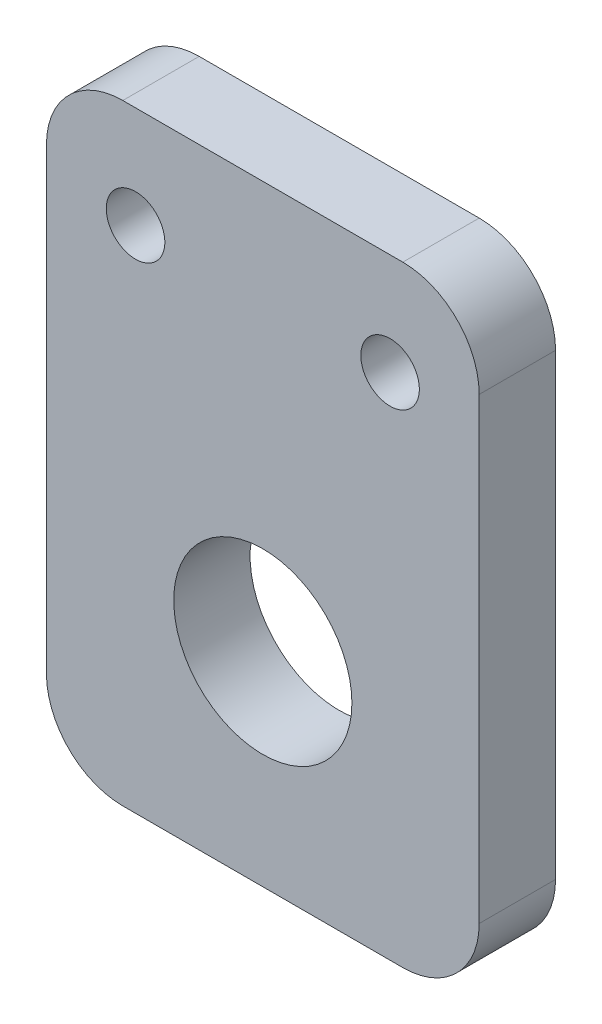
ISO-10303-21;
HEADER;
FILE_DESCRIPTION(('STEP AP214'),'2;1');
FILE_NAME('part.step','',(''),(''),'','','');
FILE_SCHEMA(('AUTOMOTIVE_DESIGN { 1 0 10303 214 1 1 1 1 }'));
ENDSEC;
DATA;
#1=APPLICATION_CONTEXT('core data for automotive mechanical design processes');
#2=APPLICATION_PROTOCOL_DEFINITION('international standard','automotive_design',2000,#1);
#3=PRODUCT_CONTEXT('',#1,'mechanical');
#4=PRODUCT('Part','Part','',(#3));
#5=PRODUCT_RELATED_PRODUCT_CATEGORY('part','',(#4));
#6=PRODUCT_DEFINITION_FORMATION('','',#4);
#7=PRODUCT_DEFINITION_CONTEXT('part definition',#1,'design');
#8=PRODUCT_DEFINITION('design','',#6,#7);
#9=PRODUCT_DEFINITION_SHAPE('','',#8);
#10=(LENGTH_UNIT() NAMED_UNIT(*) SI_UNIT(.MILLI.,.METRE.));
#11=(NAMED_UNIT(*) PLANE_ANGLE_UNIT() SI_UNIT($,.RADIAN.));
#12=(NAMED_UNIT(*) SI_UNIT($,.STERADIAN.) SOLID_ANGLE_UNIT());
#13=UNCERTAINTY_MEASURE_WITH_UNIT(LENGTH_MEASURE(1.E-05),#10,'distance_accuracy_value','');
#14=(GEOMETRIC_REPRESENTATION_CONTEXT(3) GLOBAL_UNCERTAINTY_ASSIGNED_CONTEXT((#13)) GLOBAL_UNIT_ASSIGNED_CONTEXT((#10,
#11,#12)) REPRESENTATION_CONTEXT('',''));
#15=CARTESIAN_POINT('',(0.,0.,0.));
#16=DIRECTION('',(0.,0.,1.));
#17=DIRECTION('',(1.,0.,0.));
#18=AXIS2_PLACEMENT_3D('',#15,#16,#17);
#19=CARTESIAN_POINT('',(0.,0.,3.));
#20=DIRECTION('',(0.,0.,-1.));
#21=DIRECTION('',(-1.,0.,0.));
#22=AXIS2_PLACEMENT_3D('',#19,#20,#21);
#23=PLANE('',#22);
#24=DIRECTION('',(0.,-1.,0.));
#25=VECTOR('',#24,1.);
#26=CARTESIAN_POINT('',(-8.49999999999999,0.,3.));
#27=LINE('',#26,#25);
#28=CARTESIAN_POINT('',(-8.49999999999999,21.,3.));
#29=VERTEX_POINT('',#28);
#30=CARTESIAN_POINT('',(-8.49999999999999,2.99999999999999,3.));
#31=VERTEX_POINT('',#30);
#32=EDGE_CURVE('E138',#29,#31,#27,.T.);
#33=ORIENTED_EDGE('',*,*,#32,.T.);
#34=CARTESIAN_POINT('',(-5.5,2.99999999999999,3.));
#35=DIRECTION('',(0.,0.,-1.));
#36=DIRECTION('',(-1.,0.,0.));
#37=AXIS2_PLACEMENT_3D('',#34,#35,#36);
#38=CIRCLE('',#37,3.);
#39=CARTESIAN_POINT('',(-5.5,0.,3.));
#40=VERTEX_POINT('',#39);
#41=EDGE_CURVE('E153',#31,#40,#38,.F.);
#42=ORIENTED_EDGE('',*,*,#41,.T.);
#43=DIRECTION('',(1.,0.,0.));
#44=VECTOR('',#43,1.);
#45=CARTESIAN_POINT('',(-8.49999999999999,0.,3.));
#46=LINE('',#45,#44);
#47=CARTESIAN_POINT('',(5.50000000000001,0.,3.));
#48=VERTEX_POINT('',#47);
#49=EDGE_CURVE('E120',#40,#48,#46,.T.);
#50=ORIENTED_EDGE('',*,*,#49,.T.);
#51=CARTESIAN_POINT('',(5.50000000000001,2.99999999999999,3.));
#52=DIRECTION('',(0.,0.,-1.));
#53=DIRECTION('',(-1.,0.,0.));
#54=AXIS2_PLACEMENT_3D('',#51,#52,#53);
#55=CIRCLE('',#54,3.);
#56=CARTESIAN_POINT('',(8.5,3.,3.));
#57=VERTEX_POINT('',#56);
#58=EDGE_CURVE('E151',#48,#57,#55,.F.);
#59=ORIENTED_EDGE('',*,*,#58,.T.);
#60=DIRECTION('',(0.,1.,0.));
#61=VECTOR('',#60,1.);
#62=CARTESIAN_POINT('',(8.50000000000001,0.,3.));
#63=LINE('',#62,#61);
#64=CARTESIAN_POINT('',(8.5,21.,3.));
#65=VERTEX_POINT('',#64);
#66=EDGE_CURVE('E164',#57,#65,#63,.T.);
#67=ORIENTED_EDGE('',*,*,#66,.T.);
#68=CARTESIAN_POINT('',(5.5,21.,3.));
#69=DIRECTION('',(0.,0.,-1.));
#70=DIRECTION('',(-1.,0.,0.));
#71=AXIS2_PLACEMENT_3D('',#68,#69,#70);
#72=CIRCLE('',#71,3.);
#73=CARTESIAN_POINT('',(5.5,24.,3.));
#74=VERTEX_POINT('',#73);
#75=EDGE_CURVE('E55',#65,#74,#72,.F.);
#76=ORIENTED_EDGE('',*,*,#75,.T.);
#77=DIRECTION('',(-1.,0.,0.));
#78=VECTOR('',#77,1.);
#79=CARTESIAN_POINT('',(-8.49999999999999,24.,3.));
#80=LINE('',#79,#78);
#81=CARTESIAN_POINT('',(-5.5,24.,3.));
#82=VERTEX_POINT('',#81);
#83=EDGE_CURVE('E139',#74,#82,#80,.T.);
#84=ORIENTED_EDGE('',*,*,#83,.T.);
#85=CARTESIAN_POINT('',(-5.5,21.,3.));
#86=DIRECTION('',(0.,0.,-1.));
#87=DIRECTION('',(-1.,0.,0.));
#88=AXIS2_PLACEMENT_3D('',#85,#86,#87);
#89=CIRCLE('',#88,3.);
#90=EDGE_CURVE('E148',#82,#29,#89,.F.);
#91=ORIENTED_EDGE('',*,*,#90,.T.);
#92=EDGE_LOOP('',(#33,#42,#50,#59,#67,#76,#84,#91));
#93=FACE_BOUND('',#92,.T.);
#94=CARTESIAN_POINT('',(0.,7.99999999999999,3.));
#95=DIRECTION('',(0.,0.,1.));
#96=DIRECTION('',(1.,0.,0.));
#97=AXIS2_PLACEMENT_3D('',#94,#95,#96);
#98=CIRCLE('',#97,3.5);
#99=CARTESIAN_POINT('',(3.5,7.99999999999999,3.));
#100=VERTEX_POINT('',#99);
#101=EDGE_CURVE('E133',#100,#100,#98,.T.);
#102=ORIENTED_EDGE('',*,*,#101,.F.);
#103=EDGE_LOOP('',(#102));
#104=FACE_BOUND('',#103,.T.);
#105=CARTESIAN_POINT('',(-5.,20.,3.));
#106=DIRECTION('',(0.,0.,1.));
#107=DIRECTION('',(-1.,0.,0.));
#108=AXIS2_PLACEMENT_3D('',#105,#106,#107);
#109=CIRCLE('',#108,1.15);
#110=CARTESIAN_POINT('',(-6.15,20.,3.));
#111=VERTEX_POINT('',#110);
#112=EDGE_CURVE('E181',#111,#111,#109,.T.);
#113=ORIENTED_EDGE('',*,*,#112,.F.);
#114=EDGE_LOOP('',(#113));
#115=FACE_BOUND('',#114,.T.);
#116=CARTESIAN_POINT('',(5.,20.,3.));
#117=DIRECTION('',(0.,0.,1.));
#118=DIRECTION('',(1.,0.,0.));
#119=AXIS2_PLACEMENT_3D('',#116,#117,#118);
#120=CIRCLE('',#119,1.15);
#121=CARTESIAN_POINT('',(6.15,20.,3.));
#122=VERTEX_POINT('',#121);
#123=EDGE_CURVE('E187',#122,#122,#120,.T.);
#124=ORIENTED_EDGE('',*,*,#123,.F.);
#125=EDGE_LOOP('',(#124));
#126=FACE_BOUND('',#125,.T.);
#127=ADVANCED_FACE('F34',(#93,#104,#115,#126),#23,.F.);
#128=CARTESIAN_POINT('',(0.,0.,0.));
#129=DIRECTION('',(0.,0.,-1.));
#130=DIRECTION('',(-1.,0.,0.));
#131=AXIS2_PLACEMENT_3D('',#128,#129,#130);
#132=PLANE('',#131);
#133=CARTESIAN_POINT('',(-5.,20.,0.));
#134=DIRECTION('',(0.,0.,1.));
#135=DIRECTION('',(-1.,0.,0.));
#136=AXIS2_PLACEMENT_3D('',#133,#134,#135);
#137=CIRCLE('',#136,1.15);
#138=CARTESIAN_POINT('',(-6.15,20.,0.));
#139=VERTEX_POINT('',#138);
#140=EDGE_CURVE('E184',#139,#139,#137,.T.);
#141=ORIENTED_EDGE('',*,*,#140,.T.);
#142=EDGE_LOOP('',(#141));
#143=FACE_BOUND('',#142,.T.);
#144=DIRECTION('',(1.,0.,0.));
#145=VECTOR('',#144,1.);
#146=CARTESIAN_POINT('',(-8.49999999999999,0.,0.));
#147=LINE('',#146,#145);
#148=CARTESIAN_POINT('',(-5.5,0.,0.));
#149=VERTEX_POINT('',#148);
#150=CARTESIAN_POINT('',(5.50000000000001,0.,0.));
#151=VERTEX_POINT('',#150);
#152=EDGE_CURVE('E117',#149,#151,#147,.T.);
#153=ORIENTED_EDGE('',*,*,#152,.F.);
#154=CARTESIAN_POINT('',(-5.5,2.99999999999999,0.));
#155=DIRECTION('',(0.,0.,-1.));
#156=DIRECTION('',(-1.,0.,0.));
#157=AXIS2_PLACEMENT_3D('',#154,#155,#156);
#158=CIRCLE('',#157,3.);
#159=CARTESIAN_POINT('',(-8.49999999999999,2.99999999999999,0.));
#160=VERTEX_POINT('',#159);
#161=EDGE_CURVE('E100',#149,#160,#158,.T.);
#162=ORIENTED_EDGE('',*,*,#161,.T.);
#163=DIRECTION('',(0.,-1.,0.));
#164=VECTOR('',#163,1.);
#165=CARTESIAN_POINT('',(-8.49999999999999,0.,0.));
#166=LINE('',#165,#164);
#167=CARTESIAN_POINT('',(-8.49999999999999,21.,0.));
#168=VERTEX_POINT('',#167);
#169=EDGE_CURVE('E128',#168,#160,#166,.T.);
#170=ORIENTED_EDGE('',*,*,#169,.F.);
#171=CARTESIAN_POINT('',(-5.5,21.,0.));
#172=DIRECTION('',(0.,0.,-1.));
#173=DIRECTION('',(-1.,0.,0.));
#174=AXIS2_PLACEMENT_3D('',#171,#172,#173);
#175=CIRCLE('',#174,3.);
#176=CARTESIAN_POINT('',(-5.5,24.,0.));
#177=VERTEX_POINT('',#176);
#178=EDGE_CURVE('E121',#168,#177,#175,.T.);
#179=ORIENTED_EDGE('',*,*,#178,.T.);
#180=DIRECTION('',(-1.,0.,0.));
#181=VECTOR('',#180,1.);
#182=CARTESIAN_POINT('',(-8.49999999999999,24.,0.));
#183=LINE('',#182,#181);
#184=CARTESIAN_POINT('',(5.5,24.,0.));
#185=VERTEX_POINT('',#184);
#186=EDGE_CURVE('E131',#185,#177,#183,.T.);
#187=ORIENTED_EDGE('',*,*,#186,.F.);
#188=CARTESIAN_POINT('',(5.5,21.,0.));
#189=DIRECTION('',(0.,0.,-1.));
#190=DIRECTION('',(-1.,0.,0.));
#191=AXIS2_PLACEMENT_3D('',#188,#189,#190);
#192=CIRCLE('',#191,3.);
#193=CARTESIAN_POINT('',(8.5,21.,0.));
#194=VERTEX_POINT('',#193);
#195=EDGE_CURVE('E142',#185,#194,#192,.T.);
#196=ORIENTED_EDGE('',*,*,#195,.T.);
#197=DIRECTION('',(0.,1.,0.));
#198=VECTOR('',#197,1.);
#199=CARTESIAN_POINT('',(8.50000000000001,0.,0.));
#200=LINE('',#199,#198);
#201=CARTESIAN_POINT('',(8.5,3.,0.));
#202=VERTEX_POINT('',#201);
#203=EDGE_CURVE('E127',#202,#194,#200,.T.);
#204=ORIENTED_EDGE('',*,*,#203,.F.);
#205=CARTESIAN_POINT('',(5.50000000000001,2.99999999999999,0.));
#206=DIRECTION('',(0.,0.,-1.));
#207=DIRECTION('',(-1.,0.,0.));
#208=AXIS2_PLACEMENT_3D('',#205,#206,#207);
#209=CIRCLE('',#208,3.);
#210=EDGE_CURVE('E111',#202,#151,#209,.T.);
#211=ORIENTED_EDGE('',*,*,#210,.T.);
#212=EDGE_LOOP('',(#153,#162,#170,#179,#187,#196,#204,#211));
#213=FACE_BOUND('',#212,.T.);
#214=CARTESIAN_POINT('',(0.,7.99999999999999,0.));
#215=DIRECTION('',(0.,0.,1.));
#216=DIRECTION('',(1.,0.,0.));
#217=AXIS2_PLACEMENT_3D('',#214,#215,#216);
#218=CIRCLE('',#217,3.5);
#219=CARTESIAN_POINT('',(3.5,7.99999999999999,0.));
#220=VERTEX_POINT('',#219);
#221=EDGE_CURVE('E178',#220,#220,#218,.T.);
#222=ORIENTED_EDGE('',*,*,#221,.T.);
#223=EDGE_LOOP('',(#222));
#224=FACE_BOUND('',#223,.T.);
#225=CARTESIAN_POINT('',(5.,20.,0.));
#226=DIRECTION('',(0.,0.,1.));
#227=DIRECTION('',(1.,0.,0.));
#228=AXIS2_PLACEMENT_3D('',#225,#226,#227);
#229=CIRCLE('',#228,1.15);
#230=CARTESIAN_POINT('',(6.15,20.,0.));
#231=VERTEX_POINT('',#230);
#232=EDGE_CURVE('E190',#231,#231,#229,.T.);
#233=ORIENTED_EDGE('',*,*,#232,.T.);
#234=EDGE_LOOP('',(#233));
#235=FACE_BOUND('',#234,.T.);
#236=ADVANCED_FACE('F124',(#143,#213,#224,#235),#132,.T.);
#237=CARTESIAN_POINT('',(-8.49999999999999,0.,3.));
#238=DIRECTION('',(1.,0.,0.));
#239=DIRECTION('',(0.,0.,-1.));
#240=AXIS2_PLACEMENT_3D('',#237,#238,#239);
#241=PLANE('',#240);
#242=ORIENTED_EDGE('',*,*,#169,.T.);
#243=DIRECTION('',(0.,0.,-1.));
#244=VECTOR('',#243,1.);
#245=CARTESIAN_POINT('',(-8.49999999999999,2.99999999999999,3.));
#246=LINE('',#245,#244);
#247=EDGE_CURVE('E105',#160,#31,#246,.F.);
#248=ORIENTED_EDGE('',*,*,#247,.T.);
#249=ORIENTED_EDGE('',*,*,#32,.F.);
#250=DIRECTION('',(0.,0.,-1.));
#251=VECTOR('',#250,1.);
#252=CARTESIAN_POINT('',(-8.49999999999999,21.,3.));
#253=LINE('',#252,#251);
#254=EDGE_CURVE('E110',#29,#168,#253,.T.);
#255=ORIENTED_EDGE('',*,*,#254,.T.);
#256=EDGE_LOOP('',(#242,#248,#249,#255));
#257=FACE_BOUND('',#256,.T.);
#258=ADVANCED_FACE('F204',(#257),#241,.F.);
#259=CARTESIAN_POINT('',(-8.49999999999999,0.,3.));
#260=DIRECTION('',(0.,1.,0.));
#261=DIRECTION('',(-1.,0.,0.));
#262=AXIS2_PLACEMENT_3D('',#259,#260,#261);
#263=PLANE('',#262);
#264=ORIENTED_EDGE('',*,*,#49,.F.);
#265=DIRECTION('',(0.,0.,-1.));
#266=VECTOR('',#265,1.);
#267=CARTESIAN_POINT('',(-5.5,0.,3.));
#268=LINE('',#267,#266);
#269=EDGE_CURVE('E104',#40,#149,#268,.T.);
#270=ORIENTED_EDGE('',*,*,#269,.T.);
#271=ORIENTED_EDGE('',*,*,#152,.T.);
#272=DIRECTION('',(0.,0.,-1.));
#273=VECTOR('',#272,1.);
#274=CARTESIAN_POINT('',(5.50000000000001,0.,3.));
#275=LINE('',#274,#273);
#276=EDGE_CURVE('E122',#151,#48,#275,.F.);
#277=ORIENTED_EDGE('',*,*,#276,.T.);
#278=EDGE_LOOP('',(#264,#270,#271,#277));
#279=FACE_BOUND('',#278,.T.);
#280=ADVANCED_FACE('F116',(#279),#263,.F.);
#281=CARTESIAN_POINT('',(8.50000000000001,0.,3.));
#282=DIRECTION('',(-1.,0.,0.));
#283=DIRECTION('',(0.,-1.,0.));
#284=AXIS2_PLACEMENT_3D('',#281,#282,#283);
#285=PLANE('',#284);
#286=ORIENTED_EDGE('',*,*,#66,.F.);
#287=DIRECTION('',(0.,0.,-1.));
#288=VECTOR('',#287,1.);
#289=CARTESIAN_POINT('',(8.5,3.,3.));
#290=LINE('',#289,#288);
#291=EDGE_CURVE('E157',#57,#202,#290,.T.);
#292=ORIENTED_EDGE('',*,*,#291,.T.);
#293=ORIENTED_EDGE('',*,*,#203,.T.);
#294=DIRECTION('',(0.,0.,-1.));
#295=VECTOR('',#294,1.);
#296=CARTESIAN_POINT('',(8.5,21.,3.));
#297=LINE('',#296,#295);
#298=EDGE_CURVE('E155',#194,#65,#297,.F.);
#299=ORIENTED_EDGE('',*,*,#298,.T.);
#300=EDGE_LOOP('',(#286,#292,#293,#299));
#301=FACE_BOUND('',#300,.T.);
#302=ADVANCED_FACE('F162',(#301),#285,.F.);
#303=CARTESIAN_POINT('',(-8.49999999999999,24.,3.));
#304=DIRECTION('',(0.,-1.,0.));
#305=DIRECTION('',(1.,0.,0.));
#306=AXIS2_PLACEMENT_3D('',#303,#304,#305);
#307=PLANE('',#306);
#308=ORIENTED_EDGE('',*,*,#83,.F.);
#309=DIRECTION('',(0.,0.,-1.));
#310=VECTOR('',#309,1.);
#311=CARTESIAN_POINT('',(5.5,24.,3.));
#312=LINE('',#311,#310);
#313=EDGE_CURVE('E11',#74,#185,#312,.T.);
#314=ORIENTED_EDGE('',*,*,#313,.T.);
#315=ORIENTED_EDGE('',*,*,#186,.T.);
#316=DIRECTION('',(0.,0.,-1.));
#317=VECTOR('',#316,1.);
#318=CARTESIAN_POINT('',(-5.5,24.,3.));
#319=LINE('',#318,#317);
#320=EDGE_CURVE('E42',#177,#82,#319,.F.);
#321=ORIENTED_EDGE('',*,*,#320,.T.);
#322=EDGE_LOOP('',(#308,#314,#315,#321));
#323=FACE_BOUND('',#322,.T.);
#324=ADVANCED_FACE('F171',(#323),#307,.F.);
#325=CARTESIAN_POINT('',(0.,7.99999999999999,3.));
#326=DIRECTION('',(0.,0.,-1.));
#327=DIRECTION('',(-1.,0.,0.));
#328=AXIS2_PLACEMENT_3D('',#325,#326,#327);
#329=CYLINDRICAL_SURFACE('',#328,3.5);
#330=ORIENTED_EDGE('',*,*,#101,.T.);
#331=EDGE_LOOP('',(#330));
#332=FACE_BOUND('',#331,.T.);
#333=ORIENTED_EDGE('',*,*,#221,.F.);
#334=EDGE_LOOP('',(#333));
#335=FACE_BOUND('',#334,.T.);
#336=ADVANCED_FACE('F209',(#332,#335),#329,.F.);
#337=CARTESIAN_POINT('',(-5.,20.,3.));
#338=DIRECTION('',(0.,0.,-1.));
#339=DIRECTION('',(-1.,0.,0.));
#340=AXIS2_PLACEMENT_3D('',#337,#338,#339);
#341=CYLINDRICAL_SURFACE('',#340,1.15);
#342=ORIENTED_EDGE('',*,*,#112,.T.);
#343=EDGE_LOOP('',(#342));
#344=FACE_BOUND('',#343,.T.);
#345=ORIENTED_EDGE('',*,*,#140,.F.);
#346=EDGE_LOOP('',(#345));
#347=FACE_BOUND('',#346,.T.);
#348=ADVANCED_FACE('F295',(#344,#347),#341,.F.);
#349=CARTESIAN_POINT('',(5.,20.,3.));
#350=DIRECTION('',(0.,0.,-1.));
#351=DIRECTION('',(-1.,0.,0.));
#352=AXIS2_PLACEMENT_3D('',#349,#350,#351);
#353=CYLINDRICAL_SURFACE('',#352,1.15);
#354=ORIENTED_EDGE('',*,*,#123,.T.);
#355=EDGE_LOOP('',(#354));
#356=FACE_BOUND('',#355,.T.);
#357=ORIENTED_EDGE('',*,*,#232,.F.);
#358=EDGE_LOOP('',(#357));
#359=FACE_BOUND('',#358,.T.);
#360=ADVANCED_FACE('F196',(#356,#359),#353,.F.);
#361=CARTESIAN_POINT('',(-5.5,2.99999999999999,3.));
#362=DIRECTION('',(0.,0.,-1.));
#363=DIRECTION('',(-1.,0.,0.));
#364=AXIS2_PLACEMENT_3D('',#361,#362,#363);
#365=CYLINDRICAL_SURFACE('',#364,3.);
#366=ORIENTED_EDGE('',*,*,#41,.F.);
#367=ORIENTED_EDGE('',*,*,#247,.F.);
#368=ORIENTED_EDGE('',*,*,#161,.F.);
#369=ORIENTED_EDGE('',*,*,#269,.F.);
#370=EDGE_LOOP('',(#366,#367,#368,#369));
#371=FACE_BOUND('',#370,.T.);
#372=ADVANCED_FACE('F103',(#371),#365,.T.);
#373=CARTESIAN_POINT('',(5.50000000000001,2.99999999999999,3.));
#374=DIRECTION('',(0.,0.,-1.));
#375=DIRECTION('',(-1.,0.,0.));
#376=AXIS2_PLACEMENT_3D('',#373,#374,#375);
#377=CYLINDRICAL_SURFACE('',#376,3.);
#378=ORIENTED_EDGE('',*,*,#58,.F.);
#379=ORIENTED_EDGE('',*,*,#276,.F.);
#380=ORIENTED_EDGE('',*,*,#210,.F.);
#381=ORIENTED_EDGE('',*,*,#291,.F.);
#382=EDGE_LOOP('',(#378,#379,#380,#381));
#383=FACE_BOUND('',#382,.T.);
#384=ADVANCED_FACE('F223',(#383),#377,.T.);
#385=CARTESIAN_POINT('',(5.5,21.,3.));
#386=DIRECTION('',(0.,0.,-1.));
#387=DIRECTION('',(-1.,0.,0.));
#388=AXIS2_PLACEMENT_3D('',#385,#386,#387);
#389=CYLINDRICAL_SURFACE('',#388,3.);
#390=ORIENTED_EDGE('',*,*,#75,.F.);
#391=ORIENTED_EDGE('',*,*,#298,.F.);
#392=ORIENTED_EDGE('',*,*,#195,.F.);
#393=ORIENTED_EDGE('',*,*,#313,.F.);
#394=EDGE_LOOP('',(#390,#391,#392,#393));
#395=FACE_BOUND('',#394,.T.);
#396=ADVANCED_FACE('F170',(#395),#389,.T.);
#397=CARTESIAN_POINT('',(-5.5,21.,3.));
#398=DIRECTION('',(0.,0.,-1.));
#399=DIRECTION('',(-1.,0.,0.));
#400=AXIS2_PLACEMENT_3D('',#397,#398,#399);
#401=CYLINDRICAL_SURFACE('',#400,3.);
#402=ORIENTED_EDGE('',*,*,#90,.F.);
#403=ORIENTED_EDGE('',*,*,#320,.F.);
#404=ORIENTED_EDGE('',*,*,#178,.F.);
#405=ORIENTED_EDGE('',*,*,#254,.F.);
#406=EDGE_LOOP('',(#402,#403,#404,#405));
#407=FACE_BOUND('',#406,.T.);
#408=ADVANCED_FACE('F36',(#407),#401,.T.);
#409=CLOSED_SHELL('',(#127,#236,#258,#280,#302,#324,#336,#348,#360,#372,#384,#396,#408));
#410=MANIFOLD_SOLID_BREP('B2',#409);
#411=ADVANCED_BREP_SHAPE_REPRESENTATION('',(#18,#410),#14);
#412=SHAPE_DEFINITION_REPRESENTATION(#9,#411);
ENDSEC;
END-ISO-10303-21;
